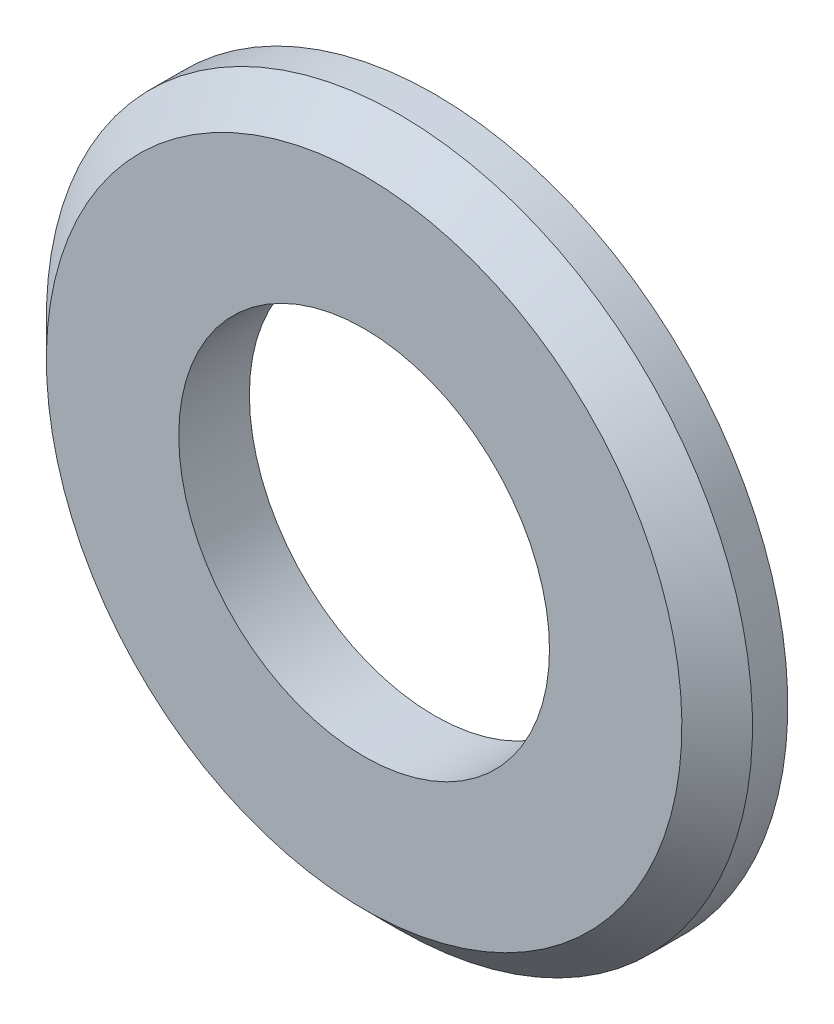
ISO-10303-21;
HEADER;
FILE_DESCRIPTION(('STEP AP214'),'2;1');
FILE_NAME('part.step','',(''),(''),'','','');
FILE_SCHEMA(('AUTOMOTIVE_DESIGN { 1 0 10303 214 1 1 1 1 }'));
ENDSEC;
DATA;
#1=APPLICATION_CONTEXT('core data for automotive mechanical design processes');
#2=APPLICATION_PROTOCOL_DEFINITION('international standard','automotive_design',2000,#1);
#3=PRODUCT_CONTEXT('',#1,'mechanical');
#4=PRODUCT('Part','Part','',(#3));
#5=PRODUCT_RELATED_PRODUCT_CATEGORY('part','',(#4));
#6=PRODUCT_DEFINITION_FORMATION('','',#4);
#7=PRODUCT_DEFINITION_CONTEXT('part definition',#1,'design');
#8=PRODUCT_DEFINITION('design','',#6,#7);
#9=PRODUCT_DEFINITION_SHAPE('','',#8);
#10=(LENGTH_UNIT() NAMED_UNIT(*) SI_UNIT(.MILLI.,.METRE.));
#11=(NAMED_UNIT(*) PLANE_ANGLE_UNIT() SI_UNIT($,.RADIAN.));
#12=(NAMED_UNIT(*) SI_UNIT($,.STERADIAN.) SOLID_ANGLE_UNIT());
#13=UNCERTAINTY_MEASURE_WITH_UNIT(LENGTH_MEASURE(1.E-05),#10,'distance_accuracy_value','');
#14=(GEOMETRIC_REPRESENTATION_CONTEXT(3) GLOBAL_UNCERTAINTY_ASSIGNED_CONTEXT((#13)) GLOBAL_UNIT_ASSIGNED_CONTEXT((#10,
#11,#12)) REPRESENTATION_CONTEXT('',''));
#15=CARTESIAN_POINT('',(0.,0.,0.));
#16=DIRECTION('',(0.,0.,1.));
#17=DIRECTION('',(1.,0.,0.));
#18=AXIS2_PLACEMENT_3D('',#15,#16,#17);
#19=CARTESIAN_POINT('',(0.,0.,0.));
#20=DIRECTION('',(0.,0.,-1.));
#21=DIRECTION('',(0.,1.,0.));
#22=AXIS2_PLACEMENT_3D('',#19,#20,#21);
#23=CYLINDRICAL_SURFACE('',#22,5.25);
#24=CARTESIAN_POINT('',(0.,0.,0.));
#25=DIRECTION('',(0.,0.,-1.));
#26=DIRECTION('',(0.,1.,0.));
#27=AXIS2_PLACEMENT_3D('',#24,#25,#26);
#28=CIRCLE('',#27,5.25);
#29=CARTESIAN_POINT('',(0.,5.25,0.));
#30=VERTEX_POINT('',#29);
#31=EDGE_CURVE('E10',#30,#30,#28,.T.);
#32=ORIENTED_EDGE('',*,*,#31,.T.);
#33=EDGE_LOOP('',(#32));
#34=FACE_BOUND('',#33,.T.);
#35=CARTESIAN_POINT('',(0.,0.,2.));
#36=DIRECTION('',(0.,0.,-1.));
#37=DIRECTION('',(0.,1.,0.));
#38=AXIS2_PLACEMENT_3D('',#35,#36,#37);
#39=CIRCLE('',#38,5.25);
#40=CARTESIAN_POINT('',(0.,5.25,2.));
#41=VERTEX_POINT('',#40);
#42=EDGE_CURVE('E43',#41,#41,#39,.T.);
#43=ORIENTED_EDGE('',*,*,#42,.F.);
#44=EDGE_LOOP('',(#43));
#45=FACE_BOUND('',#44,.T.);
#46=ADVANCED_FACE('F14',(#34,#45),#23,.F.);
#47=CARTESIAN_POINT('',(5.25,0.,0.));
#48=DIRECTION('',(0.,0.,-1.));
#49=DIRECTION('',(0.,1.,0.));
#50=AXIS2_PLACEMENT_3D('',#47,#48,#49);
#51=PLANE('',#50);
#52=CARTESIAN_POINT('',(0.,0.,0.));
#53=DIRECTION('',(0.,0.,-1.));
#54=DIRECTION('',(0.,1.,0.));
#55=AXIS2_PLACEMENT_3D('',#52,#53,#54);
#56=CIRCLE('',#55,10.);
#57=CARTESIAN_POINT('',(0.,10.,0.));
#58=VERTEX_POINT('',#57);
#59=EDGE_CURVE('E21',#58,#58,#56,.T.);
#60=ORIENTED_EDGE('',*,*,#59,.T.);
#61=EDGE_LOOP('',(#60));
#62=FACE_BOUND('',#61,.T.);
#63=ORIENTED_EDGE('',*,*,#31,.F.);
#64=EDGE_LOOP('',(#63));
#65=FACE_BOUND('',#64,.T.);
#66=ADVANCED_FACE('F52',(#62,#65),#51,.T.);
#67=CARTESIAN_POINT('',(0.,0.,0.));
#68=DIRECTION('',(0.,0.,-1.));
#69=DIRECTION('',(0.,1.,0.));
#70=AXIS2_PLACEMENT_3D('',#67,#68,#69);
#71=CYLINDRICAL_SURFACE('',#70,10.);
#72=CARTESIAN_POINT('',(0.,0.,1.));
#73=DIRECTION('',(0.,0.,-1.));
#74=DIRECTION('',(0.,1.,0.));
#75=AXIS2_PLACEMENT_3D('',#72,#73,#74);
#76=CIRCLE('',#75,10.);
#77=CARTESIAN_POINT('',(0.,10.,0.999999999999999));
#78=VERTEX_POINT('',#77);
#79=EDGE_CURVE('E30',#78,#78,#76,.T.);
#80=ORIENTED_EDGE('',*,*,#79,.T.);
#81=EDGE_LOOP('',(#80));
#82=FACE_BOUND('',#81,.T.);
#83=ORIENTED_EDGE('',*,*,#59,.F.);
#84=EDGE_LOOP('',(#83));
#85=FACE_BOUND('',#84,.T.);
#86=ADVANCED_FACE('F57',(#82,#85),#71,.T.);
#87=CARTESIAN_POINT('',(0.,0.,1.));
#88=DIRECTION('',(0.,0.,-1.));
#89=DIRECTION('',(0.,1.,0.));
#90=AXIS2_PLACEMENT_3D('',#87,#88,#89);
#91=CONICAL_SURFACE('',#90,10.,0.785398163397448);
#92=CARTESIAN_POINT('',(0.,0.,2.));
#93=DIRECTION('',(0.,0.,-1.));
#94=DIRECTION('',(0.,1.,0.));
#95=AXIS2_PLACEMENT_3D('',#92,#93,#94);
#96=CIRCLE('',#95,9.);
#97=CARTESIAN_POINT('',(0.,9.,2.));
#98=VERTEX_POINT('',#97);
#99=EDGE_CURVE('E37',#98,#98,#96,.T.);
#100=ORIENTED_EDGE('',*,*,#99,.T.);
#101=EDGE_LOOP('',(#100));
#102=FACE_BOUND('',#101,.T.);
#103=ORIENTED_EDGE('',*,*,#79,.F.);
#104=EDGE_LOOP('',(#103));
#105=FACE_BOUND('',#104,.T.);
#106=ADVANCED_FACE('F61',(#102,#105),#91,.T.);
#107=CARTESIAN_POINT('',(9.,0.,2.));
#108=DIRECTION('',(0.,0.,1.));
#109=DIRECTION('',(0.,-1.,0.));
#110=AXIS2_PLACEMENT_3D('',#107,#108,#109);
#111=PLANE('',#110);
#112=ORIENTED_EDGE('',*,*,#42,.T.);
#113=EDGE_LOOP('',(#112));
#114=FACE_BOUND('',#113,.T.);
#115=ORIENTED_EDGE('',*,*,#99,.F.);
#116=EDGE_LOOP('',(#115));
#117=FACE_BOUND('',#116,.T.);
#118=ADVANCED_FACE('F48',(#114,#117),#111,.T.);
#119=CLOSED_SHELL('',(#46,#66,#86,#106,#118));
#120=MANIFOLD_SOLID_BREP('B1',#119);
#121=ADVANCED_BREP_SHAPE_REPRESENTATION('',(#18,#120),#14);
#122=SHAPE_DEFINITION_REPRESENTATION(#9,#121);
ENDSEC;
END-ISO-10303-21;
